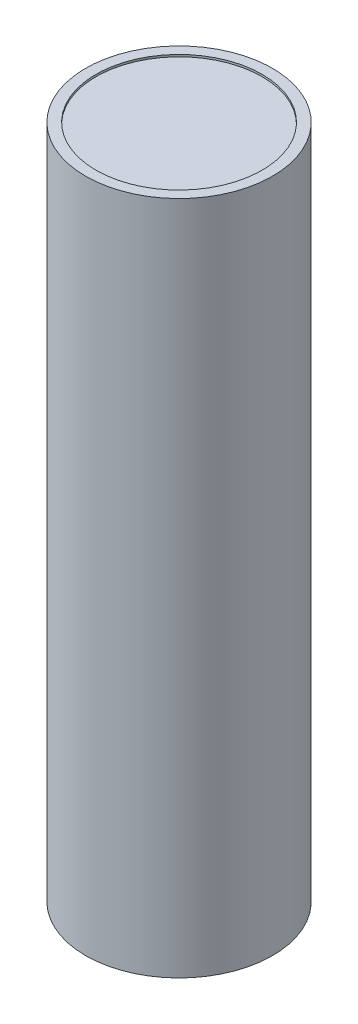
ISO-10303-21;
HEADER;
FILE_DESCRIPTION(('STEP AP214'),'2;1');
FILE_NAME('part.step','',(''),(''),'','','');
FILE_SCHEMA(('AUTOMOTIVE_DESIGN { 1 0 10303 214 1 1 1 1 }'));
ENDSEC;
DATA;
#1=APPLICATION_CONTEXT('core data for automotive mechanical design processes');
#2=APPLICATION_PROTOCOL_DEFINITION('international standard','automotive_design',2000,#1);
#3=PRODUCT_CONTEXT('',#1,'mechanical');
#4=PRODUCT('Part','Part','',(#3));
#5=PRODUCT_RELATED_PRODUCT_CATEGORY('part','',(#4));
#6=PRODUCT_DEFINITION_FORMATION('','',#4);
#7=PRODUCT_DEFINITION_CONTEXT('part definition',#1,'design');
#8=PRODUCT_DEFINITION('design','',#6,#7);
#9=PRODUCT_DEFINITION_SHAPE('','',#8);
#10=(LENGTH_UNIT() NAMED_UNIT(*) SI_UNIT(.MILLI.,.METRE.));
#11=(NAMED_UNIT(*) PLANE_ANGLE_UNIT() SI_UNIT($,.RADIAN.));
#12=(NAMED_UNIT(*) SI_UNIT($,.STERADIAN.) SOLID_ANGLE_UNIT());
#13=UNCERTAINTY_MEASURE_WITH_UNIT(LENGTH_MEASURE(1.E-05),#10,'distance_accuracy_value','');
#14=(GEOMETRIC_REPRESENTATION_CONTEXT(3) GLOBAL_UNCERTAINTY_ASSIGNED_CONTEXT((#13)) GLOBAL_UNIT_ASSIGNED_CONTEXT((#10,
#11,#12)) REPRESENTATION_CONTEXT('',''));
#15=CARTESIAN_POINT('',(0.,0.,0.));
#16=DIRECTION('',(0.,0.,1.));
#17=DIRECTION('',(1.,0.,0.));
#18=AXIS2_PLACEMENT_3D('',#15,#16,#17);
#19=CARTESIAN_POINT('',(0.,65.,0.));
#20=DIRECTION('',(0.,-1.,0.));
#21=DIRECTION('',(0.,0.,-1.));
#22=AXIS2_PLACEMENT_3D('',#19,#20,#21);
#23=CYLINDRICAL_SURFACE('',#22,9.);
#24=CARTESIAN_POINT('',(0.,65.,0.));
#25=DIRECTION('',(0.,1.,0.));
#26=DIRECTION('',(0.,0.,1.));
#27=AXIS2_PLACEMENT_3D('',#24,#25,#26);
#28=CIRCLE('',#27,9.);
#29=CARTESIAN_POINT('',(0.,65.,9.));
#30=VERTEX_POINT('',#29);
#31=EDGE_CURVE('E10',#30,#30,#28,.T.);
#32=ORIENTED_EDGE('',*,*,#31,.F.);
#33=EDGE_LOOP('',(#32));
#34=FACE_BOUND('',#33,.T.);
#35=CARTESIAN_POINT('',(0.,0.,0.));
#36=DIRECTION('',(0.,1.,0.));
#37=DIRECTION('',(0.,0.,1.));
#38=AXIS2_PLACEMENT_3D('',#35,#36,#37);
#39=CIRCLE('',#38,9.);
#40=CARTESIAN_POINT('',(0.,0.,9.));
#41=VERTEX_POINT('',#40);
#42=EDGE_CURVE('E34',#41,#41,#39,.T.);
#43=ORIENTED_EDGE('',*,*,#42,.T.);
#44=EDGE_LOOP('',(#43));
#45=FACE_BOUND('',#44,.T.);
#46=ADVANCED_FACE('F31',(#34,#45),#23,.T.);
#47=CARTESIAN_POINT('',(0.,65.,0.));
#48=DIRECTION('',(0.,1.,0.));
#49=DIRECTION('',(0.,0.,1.));
#50=AXIS2_PLACEMENT_3D('',#47,#48,#49);
#51=PLANE('',#50);
#52=CARTESIAN_POINT('',(0.,65.,0.));
#53=DIRECTION('',(0.,1.,0.));
#54=DIRECTION('',(0.,0.,1.));
#55=AXIS2_PLACEMENT_3D('',#52,#53,#54);
#56=CIRCLE('',#55,8.);
#57=CARTESIAN_POINT('',(0.,65.,8.));
#58=VERTEX_POINT('',#57);
#59=EDGE_CURVE('E43',#58,#58,#56,.T.);
#60=ORIENTED_EDGE('',*,*,#59,.F.);
#61=EDGE_LOOP('',(#60));
#62=FACE_BOUND('',#61,.T.);
#63=ORIENTED_EDGE('',*,*,#31,.T.);
#64=EDGE_LOOP('',(#63));
#65=FACE_BOUND('',#64,.T.);
#66=ADVANCED_FACE('F68',(#62,#65),#51,.T.);
#67=CARTESIAN_POINT('',(0.,0.,0.));
#68=DIRECTION('',(0.,1.,0.));
#69=DIRECTION('',(0.,0.,1.));
#70=AXIS2_PLACEMENT_3D('',#67,#68,#69);
#71=PLANE('',#70);
#72=CARTESIAN_POINT('',(0.,0.,0.));
#73=DIRECTION('',(0.,-1.,0.));
#74=DIRECTION('',(0.,0.,-1.));
#75=AXIS2_PLACEMENT_3D('',#72,#73,#74);
#76=CIRCLE('',#75,8.);
#77=CARTESIAN_POINT('',(0.,0.,-8.));
#78=VERTEX_POINT('',#77);
#79=EDGE_CURVE('E49',#78,#78,#76,.T.);
#80=ORIENTED_EDGE('',*,*,#79,.F.);
#81=EDGE_LOOP('',(#80));
#82=FACE_BOUND('',#81,.T.);
#83=ORIENTED_EDGE('',*,*,#42,.F.);
#84=EDGE_LOOP('',(#83));
#85=FACE_BOUND('',#84,.T.);
#86=ADVANCED_FACE('F64',(#82,#85),#71,.F.);
#87=CARTESIAN_POINT('',(0.,64.8,0.));
#88=DIRECTION('',(0.,1.,0.));
#89=DIRECTION('',(0.,0.,1.));
#90=AXIS2_PLACEMENT_3D('',#87,#88,#89);
#91=CYLINDRICAL_SURFACE('',#90,8.);
#92=CARTESIAN_POINT('',(0.,64.8,0.));
#93=DIRECTION('',(0.,1.,0.));
#94=DIRECTION('',(0.,0.,1.));
#95=AXIS2_PLACEMENT_3D('',#92,#93,#94);
#96=CIRCLE('',#95,8.);
#97=CARTESIAN_POINT('',(0.,64.8,8.));
#98=VERTEX_POINT('',#97);
#99=EDGE_CURVE('E41',#98,#98,#96,.T.);
#100=ORIENTED_EDGE('',*,*,#99,.F.);
#101=EDGE_LOOP('',(#100));
#102=FACE_BOUND('',#101,.T.);
#103=ORIENTED_EDGE('',*,*,#59,.T.);
#104=EDGE_LOOP('',(#103));
#105=FACE_BOUND('',#104,.T.);
#106=ADVANCED_FACE('F67',(#102,#105),#91,.F.);
#107=CARTESIAN_POINT('',(0.,64.8,0.));
#108=DIRECTION('',(0.,1.,0.));
#109=DIRECTION('',(0.,0.,1.));
#110=AXIS2_PLACEMENT_3D('',#107,#108,#109);
#111=PLANE('',#110);
#112=ORIENTED_EDGE('',*,*,#99,.T.);
#113=EDGE_LOOP('',(#112));
#114=FACE_BOUND('',#113,.T.);
#115=ADVANCED_FACE('F60',(#114),#111,.T.);
#116=CARTESIAN_POINT('',(0.,0.2,0.));
#117=DIRECTION('',(0.,-1.,0.));
#118=DIRECTION('',(0.,0.,-1.));
#119=AXIS2_PLACEMENT_3D('',#116,#117,#118);
#120=CYLINDRICAL_SURFACE('',#119,8.);
#121=CARTESIAN_POINT('',(0.,0.2,0.));
#122=DIRECTION('',(0.,-1.,0.));
#123=DIRECTION('',(0.,0.,-1.));
#124=AXIS2_PLACEMENT_3D('',#121,#122,#123);
#125=CIRCLE('',#124,8.);
#126=CARTESIAN_POINT('',(0.,0.2,-8.));
#127=VERTEX_POINT('',#126);
#128=EDGE_CURVE('E46',#127,#127,#125,.T.);
#129=ORIENTED_EDGE('',*,*,#128,.F.);
#130=EDGE_LOOP('',(#129));
#131=FACE_BOUND('',#130,.T.);
#132=ORIENTED_EDGE('',*,*,#79,.T.);
#133=EDGE_LOOP('',(#132));
#134=FACE_BOUND('',#133,.T.);
#135=ADVANCED_FACE('F57',(#131,#134),#120,.F.);
#136=CARTESIAN_POINT('',(0.,0.2,0.));
#137=DIRECTION('',(0.,-1.,0.));
#138=DIRECTION('',(0.,0.,-1.));
#139=AXIS2_PLACEMENT_3D('',#136,#137,#138);
#140=PLANE('',#139);
#141=ORIENTED_EDGE('',*,*,#128,.T.);
#142=EDGE_LOOP('',(#141));
#143=FACE_BOUND('',#142,.T.);
#144=ADVANCED_FACE('F55',(#143),#140,.T.);
#145=CLOSED_SHELL('',(#46,#66,#86,#106,#115,#135,#144));
#146=MANIFOLD_SOLID_BREP('B2',#145);
#147=ADVANCED_BREP_SHAPE_REPRESENTATION('',(#18,#146),#14);
#148=SHAPE_DEFINITION_REPRESENTATION(#9,#147);
ENDSEC;
END-ISO-10303-21;
